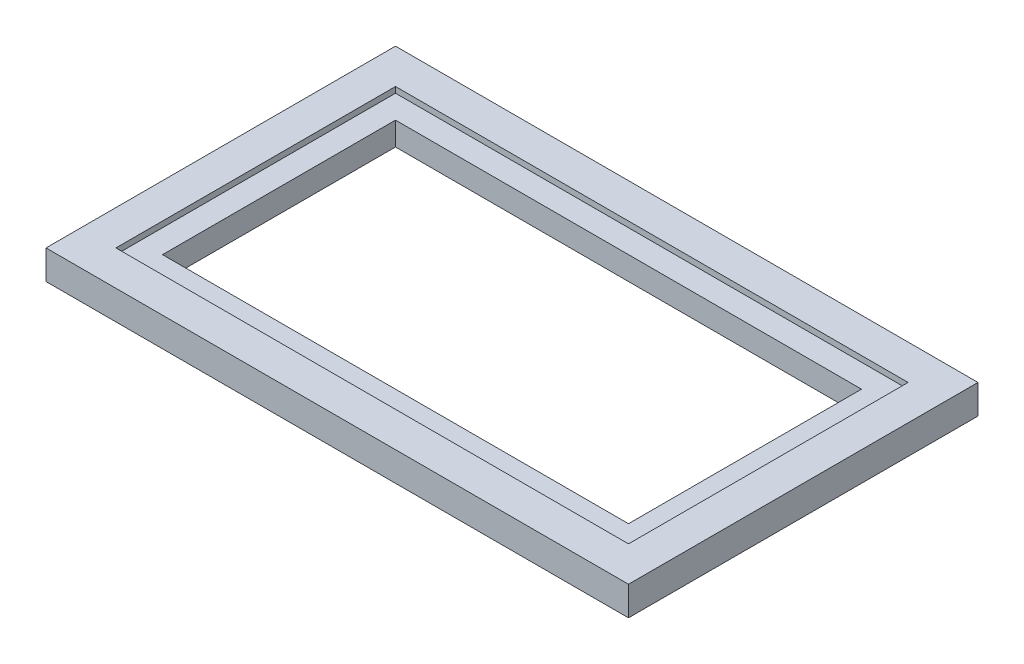
ISO-10303-21;
HEADER;
FILE_DESCRIPTION(('STEP AP214'),'2;1');
FILE_NAME('part.step','',(''),(''),'','','');
FILE_SCHEMA(('AUTOMOTIVE_DESIGN { 1 0 10303 214 1 1 1 1 }'));
ENDSEC;
DATA;
#1=APPLICATION_CONTEXT('core data for automotive mechanical design processes');
#2=APPLICATION_PROTOCOL_DEFINITION('international standard','automotive_design',2000,#1);
#3=PRODUCT_CONTEXT('',#1,'mechanical');
#4=PRODUCT('Part','Part','',(#3));
#5=PRODUCT_RELATED_PRODUCT_CATEGORY('part','',(#4));
#6=PRODUCT_DEFINITION_FORMATION('','',#4);
#7=PRODUCT_DEFINITION_CONTEXT('part definition',#1,'design');
#8=PRODUCT_DEFINITION('design','',#6,#7);
#9=PRODUCT_DEFINITION_SHAPE('','',#8);
#10=(LENGTH_UNIT() NAMED_UNIT(*) SI_UNIT(.MILLI.,.METRE.));
#11=(NAMED_UNIT(*) PLANE_ANGLE_UNIT() SI_UNIT($,.RADIAN.));
#12=(NAMED_UNIT(*) SI_UNIT($,.STERADIAN.) SOLID_ANGLE_UNIT());
#13=UNCERTAINTY_MEASURE_WITH_UNIT(LENGTH_MEASURE(1.E-05),#10,'distance_accuracy_value','');
#14=(GEOMETRIC_REPRESENTATION_CONTEXT(3) GLOBAL_UNCERTAINTY_ASSIGNED_CONTEXT((#13)) GLOBAL_UNIT_ASSIGNED_CONTEXT((#10,
#11,#12)) REPRESENTATION_CONTEXT('',''));
#15=CARTESIAN_POINT('',(0.,0.,0.));
#16=DIRECTION('',(0.,0.,1.));
#17=DIRECTION('',(1.,0.,0.));
#18=AXIS2_PLACEMENT_3D('',#15,#16,#17);
#19=CARTESIAN_POINT('',(400.,0.,-200.));
#20=DIRECTION('',(0.,0.,-1.));
#21=DIRECTION('',(-1.,0.,0.));
#22=AXIS2_PLACEMENT_3D('',#19,#20,#21);
#23=PLANE('',#22);
#24=DIRECTION('',(1.,0.,0.));
#25=VECTOR('',#24,1.);
#26=CARTESIAN_POINT('',(400.,40.,-200.));
#27=LINE('',#26,#25);
#28=CARTESIAN_POINT('',(-400.,40.,-200.));
#29=VERTEX_POINT('',#28);
#30=CARTESIAN_POINT('',(400.,40.,-200.));
#31=VERTEX_POINT('',#30);
#32=EDGE_CURVE('E164',#29,#31,#27,.T.);
#33=ORIENTED_EDGE('',*,*,#32,.F.);
#34=DIRECTION('',(0.,1.,0.));
#35=VECTOR('',#34,1.);
#36=CARTESIAN_POINT('',(-400.,0.,-200.));
#37=LINE('',#36,#35);
#38=CARTESIAN_POINT('',(-400.,0.,-200.));
#39=VERTEX_POINT('',#38);
#40=EDGE_CURVE('E178',#39,#29,#37,.T.);
#41=ORIENTED_EDGE('',*,*,#40,.F.);
#42=DIRECTION('',(-1.,0.,0.));
#43=VECTOR('',#42,1.);
#44=CARTESIAN_POINT('',(400.,0.,-200.));
#45=LINE('',#44,#43);
#46=CARTESIAN_POINT('',(400.,0.,-200.));
#47=VERTEX_POINT('',#46);
#48=EDGE_CURVE('E166',#47,#39,#45,.T.);
#49=ORIENTED_EDGE('',*,*,#48,.F.);
#50=DIRECTION('',(0.,1.,0.));
#51=VECTOR('',#50,1.);
#52=CARTESIAN_POINT('',(400.,0.,-200.));
#53=LINE('',#52,#51);
#54=EDGE_CURVE('E179',#47,#31,#53,.T.);
#55=ORIENTED_EDGE('',*,*,#54,.T.);
#56=EDGE_LOOP('',(#33,#41,#49,#55));
#57=FACE_BOUND('',#56,.T.);
#58=ADVANCED_FACE('F35',(#57),#23,.F.);
#59=CARTESIAN_POINT('',(400.,0.,200.));
#60=DIRECTION('',(1.,0.,0.));
#61=DIRECTION('',(0.,0.,-1.));
#62=AXIS2_PLACEMENT_3D('',#59,#60,#61);
#63=PLANE('',#62);
#64=DIRECTION('',(0.,0.,1.));
#65=VECTOR('',#64,1.);
#66=CARTESIAN_POINT('',(400.,40.,200.));
#67=LINE('',#66,#65);
#68=CARTESIAN_POINT('',(400.,40.,200.));
#69=VERTEX_POINT('',#68);
#70=EDGE_CURVE('E162',#31,#69,#67,.T.);
#71=ORIENTED_EDGE('',*,*,#70,.F.);
#72=ORIENTED_EDGE('',*,*,#54,.F.);
#73=DIRECTION('',(0.,0.,-1.));
#74=VECTOR('',#73,1.);
#75=CARTESIAN_POINT('',(400.,0.,200.));
#76=LINE('',#75,#74);
#77=CARTESIAN_POINT('',(400.,0.,200.));
#78=VERTEX_POINT('',#77);
#79=EDGE_CURVE('E175',#78,#47,#76,.T.);
#80=ORIENTED_EDGE('',*,*,#79,.F.);
#81=DIRECTION('',(0.,1.,0.));
#82=VECTOR('',#81,1.);
#83=CARTESIAN_POINT('',(400.,0.,200.));
#84=LINE('',#83,#82);
#85=EDGE_CURVE('E183',#78,#69,#84,.T.);
#86=ORIENTED_EDGE('',*,*,#85,.T.);
#87=EDGE_LOOP('',(#71,#72,#80,#86));
#88=FACE_BOUND('',#87,.T.);
#89=ADVANCED_FACE('F250',(#88),#63,.F.);
#90=CARTESIAN_POINT('',(-400.,0.,200.));
#91=DIRECTION('',(0.,0.,1.));
#92=DIRECTION('',(1.,0.,0.));
#93=AXIS2_PLACEMENT_3D('',#90,#91,#92);
#94=PLANE('',#93);
#95=DIRECTION('',(-1.,0.,0.));
#96=VECTOR('',#95,1.);
#97=CARTESIAN_POINT('',(-400.,40.,200.));
#98=LINE('',#97,#96);
#99=CARTESIAN_POINT('',(-400.,40.,200.));
#100=VERTEX_POINT('',#99);
#101=EDGE_CURVE('E57',#69,#100,#98,.T.);
#102=ORIENTED_EDGE('',*,*,#101,.F.);
#103=ORIENTED_EDGE('',*,*,#85,.F.);
#104=DIRECTION('',(1.,0.,0.));
#105=VECTOR('',#104,1.);
#106=CARTESIAN_POINT('',(-400.,0.,200.));
#107=LINE('',#106,#105);
#108=CARTESIAN_POINT('',(-400.,0.,200.));
#109=VERTEX_POINT('',#108);
#110=EDGE_CURVE('E172',#109,#78,#107,.T.);
#111=ORIENTED_EDGE('',*,*,#110,.F.);
#112=DIRECTION('',(0.,1.,0.));
#113=VECTOR('',#112,1.);
#114=CARTESIAN_POINT('',(-400.,0.,200.));
#115=LINE('',#114,#113);
#116=EDGE_CURVE('E186',#109,#100,#115,.T.);
#117=ORIENTED_EDGE('',*,*,#116,.T.);
#118=EDGE_LOOP('',(#102,#103,#111,#117));
#119=FACE_BOUND('',#118,.T.);
#120=ADVANCED_FACE('F255',(#119),#94,.F.);
#121=CARTESIAN_POINT('',(-400.,0.,-200.));
#122=DIRECTION('',(-1.,0.,0.));
#123=DIRECTION('',(0.,0.,1.));
#124=AXIS2_PLACEMENT_3D('',#121,#122,#123);
#125=PLANE('',#124);
#126=DIRECTION('',(0.,0.,-1.));
#127=VECTOR('',#126,1.);
#128=CARTESIAN_POINT('',(-400.,40.,-200.));
#129=LINE('',#128,#127);
#130=EDGE_CURVE('E11',#100,#29,#129,.T.);
#131=ORIENTED_EDGE('',*,*,#130,.F.);
#132=ORIENTED_EDGE('',*,*,#116,.F.);
#133=DIRECTION('',(0.,0.,1.));
#134=VECTOR('',#133,1.);
#135=CARTESIAN_POINT('',(-400.,0.,-200.));
#136=LINE('',#135,#134);
#137=EDGE_CURVE('E169',#39,#109,#136,.T.);
#138=ORIENTED_EDGE('',*,*,#137,.F.);
#139=ORIENTED_EDGE('',*,*,#40,.T.);
#140=EDGE_LOOP('',(#131,#132,#138,#139));
#141=FACE_BOUND('',#140,.T.);
#142=ADVANCED_FACE('F260',(#141),#125,.F.);
#143=CARTESIAN_POINT('',(-500.,50.,-300.));
#144=DIRECTION('',(1.,0.,0.));
#145=DIRECTION('',(0.,0.,-1.));
#146=AXIS2_PLACEMENT_3D('',#143,#144,#145);
#147=PLANE('',#146);
#148=DIRECTION('',(0.,0.,1.));
#149=VECTOR('',#148,1.);
#150=CARTESIAN_POINT('',(-500.,0.,-300.));
#151=LINE('',#150,#149);
#152=CARTESIAN_POINT('',(-500.,0.,-300.));
#153=VERTEX_POINT('',#152);
#154=CARTESIAN_POINT('',(-500.,0.,300.));
#155=VERTEX_POINT('',#154);
#156=EDGE_CURVE('E182',#153,#155,#151,.T.);
#157=ORIENTED_EDGE('',*,*,#156,.T.);
#158=DIRECTION('',(0.,-1.,0.));
#159=VECTOR('',#158,1.);
#160=CARTESIAN_POINT('',(-500.,50.,300.));
#161=LINE('',#160,#159);
#162=CARTESIAN_POINT('',(-500.,50.,300.));
#163=VERTEX_POINT('',#162);
#164=EDGE_CURVE('E43',#163,#155,#161,.T.);
#165=ORIENTED_EDGE('',*,*,#164,.F.);
#166=DIRECTION('',(0.,0.,1.));
#167=VECTOR('',#166,1.);
#168=CARTESIAN_POINT('',(-500.,50.,-300.));
#169=LINE('',#168,#167);
#170=CARTESIAN_POINT('',(-500.,50.,-300.));
#171=VERTEX_POINT('',#170);
#172=EDGE_CURVE('E191',#171,#163,#169,.T.);
#173=ORIENTED_EDGE('',*,*,#172,.F.);
#174=DIRECTION('',(0.,-1.,0.));
#175=VECTOR('',#174,1.);
#176=CARTESIAN_POINT('',(-500.,50.,-300.));
#177=LINE('',#176,#175);
#178=EDGE_CURVE('E201',#171,#153,#177,.T.);
#179=ORIENTED_EDGE('',*,*,#178,.T.);
#180=EDGE_LOOP('',(#157,#165,#173,#179));
#181=FACE_BOUND('',#180,.T.);
#182=ADVANCED_FACE('F37',(#181),#147,.F.);
#183=CARTESIAN_POINT('',(500.,50.,300.));
#184=DIRECTION('',(0.,0.,-1.));
#185=DIRECTION('',(-1.,0.,0.));
#186=AXIS2_PLACEMENT_3D('',#183,#184,#185);
#187=PLANE('',#186);
#188=DIRECTION('',(1.,0.,0.));
#189=VECTOR('',#188,1.);
#190=CARTESIAN_POINT('',(500.,0.,300.));
#191=LINE('',#190,#189);
#192=CARTESIAN_POINT('',(500.,0.,300.));
#193=VERTEX_POINT('',#192);
#194=EDGE_CURVE('E204',#155,#193,#191,.T.);
#195=ORIENTED_EDGE('',*,*,#194,.T.);
#196=DIRECTION('',(0.,-1.,0.));
#197=VECTOR('',#196,1.);
#198=CARTESIAN_POINT('',(500.,50.,300.));
#199=LINE('',#198,#197);
#200=CARTESIAN_POINT('',(500.,50.,300.));
#201=VERTEX_POINT('',#200);
#202=EDGE_CURVE('E214',#201,#193,#199,.T.);
#203=ORIENTED_EDGE('',*,*,#202,.F.);
#204=DIRECTION('',(1.,0.,0.));
#205=VECTOR('',#204,1.);
#206=CARTESIAN_POINT('',(500.,50.,300.));
#207=LINE('',#206,#205);
#208=EDGE_CURVE('E194',#163,#201,#207,.T.);
#209=ORIENTED_EDGE('',*,*,#208,.F.);
#210=ORIENTED_EDGE('',*,*,#164,.T.);
#211=EDGE_LOOP('',(#195,#203,#209,#210));
#212=FACE_BOUND('',#211,.T.);
#213=ADVANCED_FACE('F219',(#212),#187,.F.);
#214=CARTESIAN_POINT('',(500.,50.,-300.));
#215=DIRECTION('',(-1.,0.,0.));
#216=DIRECTION('',(0.,0.,1.));
#217=AXIS2_PLACEMENT_3D('',#214,#215,#216);
#218=PLANE('',#217);
#219=DIRECTION('',(0.,0.,-1.));
#220=VECTOR('',#219,1.);
#221=CARTESIAN_POINT('',(500.,0.,-300.));
#222=LINE('',#221,#220);
#223=CARTESIAN_POINT('',(500.,0.,-300.));
#224=VERTEX_POINT('',#223);
#225=EDGE_CURVE('E206',#193,#224,#222,.T.);
#226=ORIENTED_EDGE('',*,*,#225,.T.);
#227=DIRECTION('',(0.,-1.,0.));
#228=VECTOR('',#227,1.);
#229=CARTESIAN_POINT('',(500.,50.,-300.));
#230=LINE('',#229,#228);
#231=CARTESIAN_POINT('',(500.,50.,-300.));
#232=VERTEX_POINT('',#231);
#233=EDGE_CURVE('E211',#232,#224,#230,.T.);
#234=ORIENTED_EDGE('',*,*,#233,.F.);
#235=DIRECTION('',(0.,0.,-1.));
#236=VECTOR('',#235,1.);
#237=CARTESIAN_POINT('',(500.,50.,-300.));
#238=LINE('',#237,#236);
#239=EDGE_CURVE('E197',#201,#232,#238,.T.);
#240=ORIENTED_EDGE('',*,*,#239,.F.);
#241=ORIENTED_EDGE('',*,*,#202,.T.);
#242=EDGE_LOOP('',(#226,#234,#240,#241));
#243=FACE_BOUND('',#242,.T.);
#244=ADVANCED_FACE('F231',(#243),#218,.F.);
#245=CARTESIAN_POINT('',(500.,50.,-300.));
#246=DIRECTION('',(0.,0.,1.));
#247=DIRECTION('',(1.,0.,0.));
#248=AXIS2_PLACEMENT_3D('',#245,#246,#247);
#249=PLANE('',#248);
#250=DIRECTION('',(-1.,0.,0.));
#251=VECTOR('',#250,1.);
#252=CARTESIAN_POINT('',(500.,0.,-300.));
#253=LINE('',#252,#251);
#254=EDGE_CURVE('E195',#224,#153,#253,.T.);
#255=ORIENTED_EDGE('',*,*,#254,.T.);
#256=ORIENTED_EDGE('',*,*,#178,.F.);
#257=DIRECTION('',(-1.,0.,0.));
#258=VECTOR('',#257,1.);
#259=CARTESIAN_POINT('',(500.,50.,-300.));
#260=LINE('',#259,#258);
#261=EDGE_CURVE('E199',#232,#171,#260,.T.);
#262=ORIENTED_EDGE('',*,*,#261,.F.);
#263=ORIENTED_EDGE('',*,*,#233,.T.);
#264=EDGE_LOOP('',(#255,#256,#262,#263));
#265=FACE_BOUND('',#264,.T.);
#266=ADVANCED_FACE('F235',(#265),#249,.F.);
#267=CARTESIAN_POINT('',(0.,50.,0.));
#268=DIRECTION('',(0.,-1.,0.));
#269=DIRECTION('',(0.,0.,-1.));
#270=AXIS2_PLACEMENT_3D('',#267,#268,#269);
#271=PLANE('',#270);
#272=DIRECTION('',(0.,0.,1.));
#273=VECTOR('',#272,1.);
#274=CARTESIAN_POINT('',(-440.,50.,-240.));
#275=LINE('',#274,#273);
#276=CARTESIAN_POINT('',(-440.,50.,-240.));
#277=VERTEX_POINT('',#276);
#278=CARTESIAN_POINT('',(-440.,50.,240.));
#279=VERTEX_POINT('',#278);
#280=EDGE_CURVE('E152',#277,#279,#275,.T.);
#281=ORIENTED_EDGE('',*,*,#280,.F.);
#282=DIRECTION('',(-1.,0.,0.));
#283=VECTOR('',#282,1.);
#284=CARTESIAN_POINT('',(440.,50.,-240.));
#285=LINE('',#284,#283);
#286=CARTESIAN_POINT('',(440.,50.,-240.));
#287=VERTEX_POINT('',#286);
#288=EDGE_CURVE('E50',#287,#277,#285,.T.);
#289=ORIENTED_EDGE('',*,*,#288,.F.);
#290=DIRECTION('',(0.,0.,-1.));
#291=VECTOR('',#290,1.);
#292=CARTESIAN_POINT('',(440.,50.,240.));
#293=LINE('',#292,#291);
#294=CARTESIAN_POINT('',(440.,50.,240.));
#295=VERTEX_POINT('',#294);
#296=EDGE_CURVE('E143',#295,#287,#293,.T.);
#297=ORIENTED_EDGE('',*,*,#296,.F.);
#298=DIRECTION('',(1.,0.,0.));
#299=VECTOR('',#298,1.);
#300=CARTESIAN_POINT('',(-440.,50.,240.));
#301=LINE('',#300,#299);
#302=EDGE_CURVE('E146',#279,#295,#301,.T.);
#303=ORIENTED_EDGE('',*,*,#302,.F.);
#304=EDGE_LOOP('',(#281,#289,#297,#303));
#305=FACE_BOUND('',#304,.T.);
#306=ORIENTED_EDGE('',*,*,#172,.T.);
#307=ORIENTED_EDGE('',*,*,#208,.T.);
#308=ORIENTED_EDGE('',*,*,#239,.T.);
#309=ORIENTED_EDGE('',*,*,#261,.T.);
#310=EDGE_LOOP('',(#306,#307,#308,#309));
#311=FACE_BOUND('',#310,.T.);
#312=ADVANCED_FACE('F237',(#305,#311),#271,.F.);
#313=CARTESIAN_POINT('',(0.,0.,0.));
#314=DIRECTION('',(0.,-1.,0.));
#315=DIRECTION('',(0.,0.,-1.));
#316=AXIS2_PLACEMENT_3D('',#313,#314,#315);
#317=PLANE('',#316);
#318=ORIENTED_EDGE('',*,*,#48,.T.);
#319=ORIENTED_EDGE('',*,*,#137,.T.);
#320=ORIENTED_EDGE('',*,*,#110,.T.);
#321=ORIENTED_EDGE('',*,*,#79,.T.);
#322=EDGE_LOOP('',(#318,#319,#320,#321));
#323=FACE_BOUND('',#322,.T.);
#324=ORIENTED_EDGE('',*,*,#156,.F.);
#325=ORIENTED_EDGE('',*,*,#254,.F.);
#326=ORIENTED_EDGE('',*,*,#225,.F.);
#327=ORIENTED_EDGE('',*,*,#194,.F.);
#328=EDGE_LOOP('',(#324,#325,#326,#327));
#329=FACE_BOUND('',#328,.T.);
#330=ADVANCED_FACE('F227',(#323,#329),#317,.T.);
#331=CARTESIAN_POINT('',(0.,40.,0.));
#332=DIRECTION('',(0.,1.,0.));
#333=DIRECTION('',(0.,0.,1.));
#334=AXIS2_PLACEMENT_3D('',#331,#332,#333);
#335=PLANE('',#334);
#336=DIRECTION('',(-1.,0.,0.));
#337=VECTOR('',#336,1.);
#338=CARTESIAN_POINT('',(440.,40.,-240.));
#339=LINE('',#338,#337);
#340=CARTESIAN_POINT('',(440.,40.,-240.));
#341=VERTEX_POINT('',#340);
#342=CARTESIAN_POINT('',(-440.,40.,-240.));
#343=VERTEX_POINT('',#342);
#344=EDGE_CURVE('E125',#341,#343,#339,.T.);
#345=ORIENTED_EDGE('',*,*,#344,.T.);
#346=DIRECTION('',(0.,0.,1.));
#347=VECTOR('',#346,1.);
#348=CARTESIAN_POINT('',(-440.,40.,-240.));
#349=LINE('',#348,#347);
#350=CARTESIAN_POINT('',(-440.,40.,240.));
#351=VERTEX_POINT('',#350);
#352=EDGE_CURVE('E134',#343,#351,#349,.T.);
#353=ORIENTED_EDGE('',*,*,#352,.T.);
#354=DIRECTION('',(1.,0.,0.));
#355=VECTOR('',#354,1.);
#356=CARTESIAN_POINT('',(-440.,40.,240.));
#357=LINE('',#356,#355);
#358=CARTESIAN_POINT('',(440.,40.,240.));
#359=VERTEX_POINT('',#358);
#360=EDGE_CURVE('E139',#351,#359,#357,.T.);
#361=ORIENTED_EDGE('',*,*,#360,.T.);
#362=DIRECTION('',(0.,0.,-1.));
#363=VECTOR('',#362,1.);
#364=CARTESIAN_POINT('',(440.,40.,240.));
#365=LINE('',#364,#363);
#366=EDGE_CURVE('E131',#359,#341,#365,.T.);
#367=ORIENTED_EDGE('',*,*,#366,.T.);
#368=EDGE_LOOP('',(#345,#353,#361,#367));
#369=FACE_BOUND('',#368,.T.);
#370=ORIENTED_EDGE('',*,*,#32,.T.);
#371=ORIENTED_EDGE('',*,*,#70,.T.);
#372=ORIENTED_EDGE('',*,*,#101,.T.);
#373=ORIENTED_EDGE('',*,*,#130,.T.);
#374=EDGE_LOOP('',(#370,#371,#372,#373));
#375=FACE_BOUND('',#374,.T.);
#376=ADVANCED_FACE('F141',(#369,#375),#335,.T.);
#377=CARTESIAN_POINT('',(440.,40.,-240.));
#378=DIRECTION('',(0.,0.,-1.));
#379=DIRECTION('',(-1.,0.,0.));
#380=AXIS2_PLACEMENT_3D('',#377,#378,#379);
#381=PLANE('',#380);
#382=ORIENTED_EDGE('',*,*,#288,.T.);
#383=DIRECTION('',(0.,1.,0.));
#384=VECTOR('',#383,1.);
#385=CARTESIAN_POINT('',(-440.,40.,-240.));
#386=LINE('',#385,#384);
#387=EDGE_CURVE('E121',#343,#277,#386,.T.);
#388=ORIENTED_EDGE('',*,*,#387,.F.);
#389=ORIENTED_EDGE('',*,*,#344,.F.);
#390=DIRECTION('',(0.,1.,0.));
#391=VECTOR('',#390,1.);
#392=CARTESIAN_POINT('',(440.,40.,-240.));
#393=LINE('',#392,#391);
#394=EDGE_CURVE('E156',#341,#287,#393,.T.);
#395=ORIENTED_EDGE('',*,*,#394,.T.);
#396=EDGE_LOOP('',(#382,#388,#389,#395));
#397=FACE_BOUND('',#396,.T.);
#398=ADVANCED_FACE('F123',(#397),#381,.F.);
#399=CARTESIAN_POINT('',(440.,40.,240.));
#400=DIRECTION('',(1.,0.,0.));
#401=DIRECTION('',(0.,0.,-1.));
#402=AXIS2_PLACEMENT_3D('',#399,#400,#401);
#403=PLANE('',#402);
#404=ORIENTED_EDGE('',*,*,#296,.T.);
#405=ORIENTED_EDGE('',*,*,#394,.F.);
#406=ORIENTED_EDGE('',*,*,#366,.F.);
#407=DIRECTION('',(0.,1.,0.));
#408=VECTOR('',#407,1.);
#409=CARTESIAN_POINT('',(440.,40.,240.));
#410=LINE('',#409,#408);
#411=EDGE_CURVE('E158',#359,#295,#410,.T.);
#412=ORIENTED_EDGE('',*,*,#411,.T.);
#413=EDGE_LOOP('',(#404,#405,#406,#412));
#414=FACE_BOUND('',#413,.T.);
#415=ADVANCED_FACE('F269',(#414),#403,.F.);
#416=CARTESIAN_POINT('',(-440.,40.,240.));
#417=DIRECTION('',(0.,0.,1.));
#418=DIRECTION('',(1.,0.,0.));
#419=AXIS2_PLACEMENT_3D('',#416,#417,#418);
#420=PLANE('',#419);
#421=ORIENTED_EDGE('',*,*,#302,.T.);
#422=ORIENTED_EDGE('',*,*,#411,.F.);
#423=ORIENTED_EDGE('',*,*,#360,.F.);
#424=DIRECTION('',(0.,1.,0.));
#425=VECTOR('',#424,1.);
#426=CARTESIAN_POINT('',(-440.,40.,240.));
#427=LINE('',#426,#425);
#428=EDGE_CURVE('E130',#351,#279,#427,.T.);
#429=ORIENTED_EDGE('',*,*,#428,.T.);
#430=EDGE_LOOP('',(#421,#422,#423,#429));
#431=FACE_BOUND('',#430,.T.);
#432=ADVANCED_FACE('F272',(#431),#420,.F.);
#433=CARTESIAN_POINT('',(-440.,40.,-240.));
#434=DIRECTION('',(-1.,0.,0.));
#435=DIRECTION('',(0.,0.,1.));
#436=AXIS2_PLACEMENT_3D('',#433,#434,#435);
#437=PLANE('',#436);
#438=ORIENTED_EDGE('',*,*,#280,.T.);
#439=ORIENTED_EDGE('',*,*,#428,.F.);
#440=ORIENTED_EDGE('',*,*,#352,.F.);
#441=ORIENTED_EDGE('',*,*,#387,.T.);
#442=EDGE_LOOP('',(#438,#439,#440,#441));
#443=FACE_BOUND('',#442,.T.);
#444=ADVANCED_FACE('F135',(#443),#437,.F.);
#445=CLOSED_SHELL('',(#58,#89,#120,#142,#182,#213,#244,#266,#312,#330,#376,#398,#415,#432,#444));
#446=MANIFOLD_SOLID_BREP('B2',#445);
#447=ADVANCED_BREP_SHAPE_REPRESENTATION('',(#18,#446),#14);
#448=SHAPE_DEFINITION_REPRESENTATION(#9,#447);
ENDSEC;
END-ISO-10303-21;
